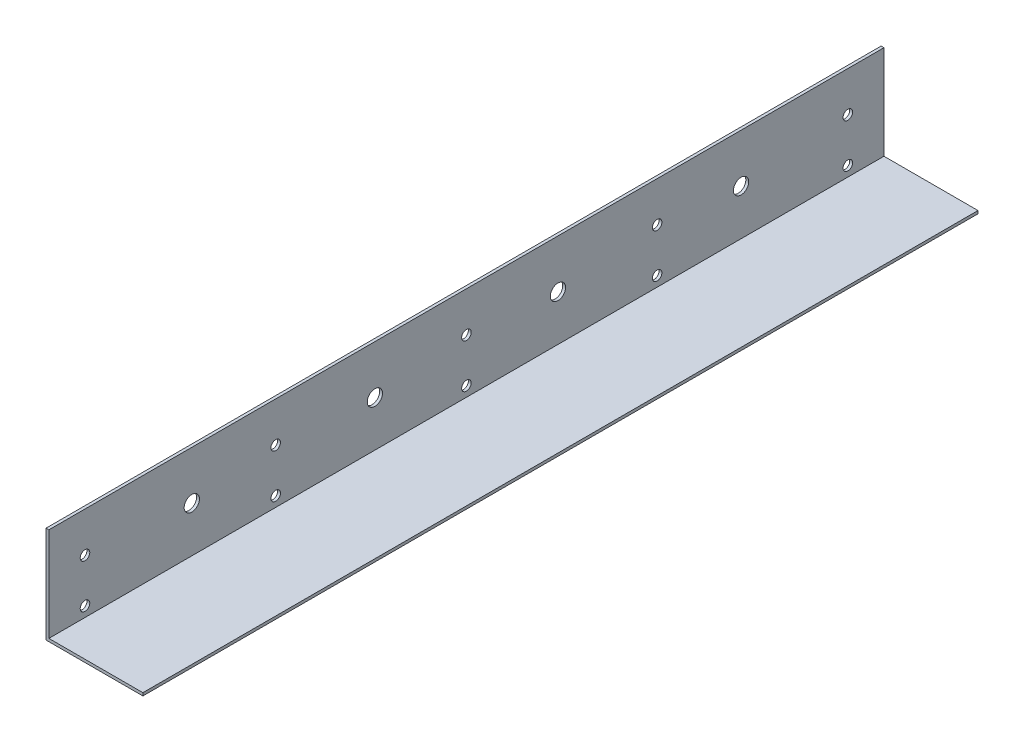
ISO-10303-21;
HEADER;
FILE_DESCRIPTION(('STEP AP214'),'2;1');
FILE_NAME('part.step','',(''),(''),'','','');
FILE_SCHEMA(('AUTOMOTIVE_DESIGN { 1 0 10303 214 1 1 1 1 }'));
ENDSEC;
DATA;
#1=APPLICATION_CONTEXT('core data for automotive mechanical design processes');
#2=APPLICATION_PROTOCOL_DEFINITION('international standard','automotive_design',2000,#1);
#3=PRODUCT_CONTEXT('',#1,'mechanical');
#4=PRODUCT('Part','Part','',(#3));
#5=PRODUCT_RELATED_PRODUCT_CATEGORY('part','',(#4));
#6=PRODUCT_DEFINITION_FORMATION('','',#4);
#7=PRODUCT_DEFINITION_CONTEXT('part definition',#1,'design');
#8=PRODUCT_DEFINITION('design','',#6,#7);
#9=PRODUCT_DEFINITION_SHAPE('','',#8);
#10=(LENGTH_UNIT() NAMED_UNIT(*) SI_UNIT(.MILLI.,.METRE.));
#11=(NAMED_UNIT(*) PLANE_ANGLE_UNIT() SI_UNIT($,.RADIAN.));
#12=(NAMED_UNIT(*) SI_UNIT($,.STERADIAN.) SOLID_ANGLE_UNIT());
#13=UNCERTAINTY_MEASURE_WITH_UNIT(LENGTH_MEASURE(1.E-05),#10,'distance_accuracy_value','');
#14=(GEOMETRIC_REPRESENTATION_CONTEXT(3) GLOBAL_UNCERTAINTY_ASSIGNED_CONTEXT((#13)) GLOBAL_UNIT_ASSIGNED_CONTEXT((#10,
#11,#12)) REPRESENTATION_CONTEXT('',''));
#15=CARTESIAN_POINT('',(0.,0.,0.));
#16=DIRECTION('',(0.,0.,1.));
#17=DIRECTION('',(1.,0.,0.));
#18=AXIS2_PLACEMENT_3D('',#15,#16,#17);
#19=CARTESIAN_POINT('',(0.,-2.22044604925031E-13,437.896));
#20=DIRECTION('',(0.,1.,0.));
#21=DIRECTION('',(0.,0.,1.));
#22=AXIS2_PLACEMENT_3D('',#19,#20,#21);
#23=PLANE('',#22);
#24=DIRECTION('',(1.,0.,0.));
#25=VECTOR('',#24,1.);
#26=CARTESIAN_POINT('',(0.,0.,0.));
#27=LINE('',#26,#25);
#28=CARTESIAN_POINT('',(0.,0.,0.));
#29=VERTEX_POINT('',#28);
#30=CARTESIAN_POINT('',(50.8,0.,0.));
#31=VERTEX_POINT('',#30);
#32=EDGE_CURVE('E120',#29,#31,#27,.T.);
#33=ORIENTED_EDGE('',*,*,#32,.T.);
#34=DIRECTION('',(0.,0.,-1.));
#35=VECTOR('',#34,1.);
#36=CARTESIAN_POINT('',(50.8,-1.66533453693773E-13,437.896));
#37=LINE('',#36,#35);
#38=CARTESIAN_POINT('',(50.8,-1.66533453693773E-13,437.896));
#39=VERTEX_POINT('',#38);
#40=EDGE_CURVE('E11',#39,#31,#37,.T.);
#41=ORIENTED_EDGE('',*,*,#40,.F.);
#42=DIRECTION('',(1.,0.,0.));
#43=VECTOR('',#42,1.);
#44=CARTESIAN_POINT('',(0.,-2.22044604925031E-13,437.896));
#45=LINE('',#44,#43);
#46=CARTESIAN_POINT('',(0.,-2.22044604925031E-13,437.896));
#47=VERTEX_POINT('',#46);
#48=EDGE_CURVE('E131',#47,#39,#45,.T.);
#49=ORIENTED_EDGE('',*,*,#48,.F.);
#50=DIRECTION('',(0.,0.,-1.));
#51=VECTOR('',#50,1.);
#52=CARTESIAN_POINT('',(0.,-2.22044604925031E-13,437.896));
#53=LINE('',#52,#51);
#54=EDGE_CURVE('E116',#47,#29,#53,.T.);
#55=ORIENTED_EDGE('',*,*,#54,.T.);
#56=EDGE_LOOP('',(#33,#41,#49,#55));
#57=FACE_BOUND('',#56,.T.);
#58=ADVANCED_FACE('F36',(#57),#23,.F.);
#59=CARTESIAN_POINT('',(50.8,1.49999699999981,437.896));
#60=DIRECTION('',(-1.,0.,0.));
#61=DIRECTION('',(0.,0.,1.));
#62=AXIS2_PLACEMENT_3D('',#59,#60,#61);
#63=PLANE('',#62);
#64=DIRECTION('',(0.,1.,0.));
#65=VECTOR('',#64,1.);
#66=CARTESIAN_POINT('',(50.8,1.49999700000003,0.));
#67=LINE('',#66,#65);
#68=CARTESIAN_POINT('',(50.8,1.49999700000003,0.));
#69=VERTEX_POINT('',#68);
#70=EDGE_CURVE('E123',#31,#69,#67,.T.);
#71=ORIENTED_EDGE('',*,*,#70,.T.);
#72=DIRECTION('',(0.,0.,-1.));
#73=VECTOR('',#72,1.);
#74=CARTESIAN_POINT('',(50.8,1.49999699999981,437.896));
#75=LINE('',#74,#73);
#76=CARTESIAN_POINT('',(50.8,1.49999699999981,437.896));
#77=VERTEX_POINT('',#76);
#78=EDGE_CURVE('E44',#77,#69,#75,.T.);
#79=ORIENTED_EDGE('',*,*,#78,.F.);
#80=DIRECTION('',(0.,1.,0.));
#81=VECTOR('',#80,1.);
#82=CARTESIAN_POINT('',(50.8,1.49999699999981,437.896));
#83=LINE('',#82,#81);
#84=EDGE_CURVE('E89',#39,#77,#83,.T.);
#85=ORIENTED_EDGE('',*,*,#84,.F.);
#86=ORIENTED_EDGE('',*,*,#40,.T.);
#87=EDGE_LOOP('',(#71,#79,#85,#86));
#88=FACE_BOUND('',#87,.T.);
#89=ADVANCED_FACE('F158',(#88),#63,.F.);
#90=CARTESIAN_POINT('',(1.499997,1.49999699999981,437.896));
#91=DIRECTION('',(0.,-1.,0.));
#92=DIRECTION('',(0.,0.,-1.));
#93=AXIS2_PLACEMENT_3D('',#90,#91,#92);
#94=PLANE('',#93);
#95=DIRECTION('',(-1.,0.,0.));
#96=VECTOR('',#95,1.);
#97=CARTESIAN_POINT('',(1.499997,1.49999699999998,0.));
#98=LINE('',#97,#96);
#99=CARTESIAN_POINT('',(1.499997,1.49999699999998,0.));
#100=VERTEX_POINT('',#99);
#101=EDGE_CURVE('E126',#69,#100,#98,.T.);
#102=ORIENTED_EDGE('',*,*,#101,.T.);
#103=DIRECTION('',(0.,0.,-1.));
#104=VECTOR('',#103,1.);
#105=CARTESIAN_POINT('',(1.499997,1.49999699999981,437.896));
#106=LINE('',#105,#104);
#107=CARTESIAN_POINT('',(1.499997,1.49999699999981,437.896));
#108=VERTEX_POINT('',#107);
#109=EDGE_CURVE('E111',#108,#100,#106,.T.);
#110=ORIENTED_EDGE('',*,*,#109,.F.);
#111=DIRECTION('',(-1.,0.,0.));
#112=VECTOR('',#111,1.);
#113=CARTESIAN_POINT('',(1.499997,1.49999699999981,437.896));
#114=LINE('',#113,#112);
#115=EDGE_CURVE('E102',#77,#108,#114,.T.);
#116=ORIENTED_EDGE('',*,*,#115,.F.);
#117=ORIENTED_EDGE('',*,*,#78,.T.);
#118=EDGE_LOOP('',(#102,#110,#116,#117));
#119=FACE_BOUND('',#118,.T.);
#120=ADVANCED_FACE('F137',(#119),#94,.F.);
#121=CARTESIAN_POINT('',(1.499997,1.49999699999981,437.896));
#122=DIRECTION('',(-1.,0.,0.));
#123=DIRECTION('',(0.,0.,1.));
#124=AXIS2_PLACEMENT_3D('',#121,#122,#123);
#125=PLANE('',#124);
#126=CARTESIAN_POINT('',(1.499997,29.8000000000049,118.948));
#127=DIRECTION('',(-1.,0.,0.));
#128=DIRECTION('',(0.,0.,1.));
#129=AXIS2_PLACEMENT_3D('',#126,#127,#128);
#130=CIRCLE('',#129,2.49999999999999);
#131=CARTESIAN_POINT('',(1.499997,29.8000000000049,121.448));
#132=VERTEX_POINT('',#131);
#133=EDGE_CURVE('E174',#132,#132,#130,.F.);
#134=ORIENTED_EDGE('',*,*,#133,.F.);
#135=EDGE_LOOP('',(#134));
#136=FACE_BOUND('',#135,.T.);
#137=CARTESIAN_POINT('',(1.499997,29.8000000000057,218.948));
#138=DIRECTION('',(-1.,0.,0.));
#139=DIRECTION('',(0.,0.,1.));
#140=AXIS2_PLACEMENT_3D('',#137,#138,#139);
#141=CIRCLE('',#140,2.5);
#142=CARTESIAN_POINT('',(1.499997,29.8000000000057,221.448));
#143=VERTEX_POINT('',#142);
#144=EDGE_CURVE('E178',#143,#143,#141,.F.);
#145=ORIENTED_EDGE('',*,*,#144,.F.);
#146=EDGE_LOOP('',(#145));
#147=FACE_BOUND('',#146,.T.);
#148=CARTESIAN_POINT('',(1.49999700000011,29.8000000000067,318.948));
#149=DIRECTION('',(-1.,0.,0.));
#150=DIRECTION('',(0.,0.,1.));
#151=AXIS2_PLACEMENT_3D('',#148,#149,#150);
#152=CIRCLE('',#151,2.50000000000002);
#153=CARTESIAN_POINT('',(1.49999700000011,29.8000000000067,321.448));
#154=VERTEX_POINT('',#153);
#155=EDGE_CURVE('E182',#154,#154,#152,.F.);
#156=ORIENTED_EDGE('',*,*,#155,.F.);
#157=EDGE_LOOP('',(#156));
#158=FACE_BOUND('',#157,.T.);
#159=CARTESIAN_POINT('',(1.4999970000001,29.8000000000077,418.948));
#160=DIRECTION('',(-1.,0.,0.));
#161=DIRECTION('',(0.,0.,1.));
#162=AXIS2_PLACEMENT_3D('',#159,#160,#161);
#163=CIRCLE('',#162,2.50000000000002);
#164=CARTESIAN_POINT('',(1.4999970000001,29.8000000000077,421.448));
#165=VERTEX_POINT('',#164);
#166=EDGE_CURVE('E186',#165,#165,#163,.F.);
#167=ORIENTED_EDGE('',*,*,#166,.F.);
#168=EDGE_LOOP('',(#167));
#169=FACE_BOUND('',#168,.T.);
#170=CARTESIAN_POINT('',(1.499997,6.8000000000088,318.948));
#171=DIRECTION('',(-1.,0.,0.));
#172=DIRECTION('',(0.,0.,1.));
#173=AXIS2_PLACEMENT_3D('',#170,#171,#172);
#174=CIRCLE('',#173,2.50000000000002);
#175=CARTESIAN_POINT('',(1.499997,6.8000000000088,321.448));
#176=VERTEX_POINT('',#175);
#177=EDGE_CURVE('E190',#176,#176,#174,.F.);
#178=ORIENTED_EDGE('',*,*,#177,.F.);
#179=EDGE_LOOP('',(#178));
#180=FACE_BOUND('',#179,.T.);
#181=CARTESIAN_POINT('',(1.499997,6.80000000001119,118.948));
#182=DIRECTION('',(-1.,0.,0.));
#183=DIRECTION('',(0.,0.,1.));
#184=AXIS2_PLACEMENT_3D('',#181,#182,#183);
#185=CIRCLE('',#184,2.5);
#186=CARTESIAN_POINT('',(1.499997,6.80000000001119,121.448));
#187=VERTEX_POINT('',#186);
#188=EDGE_CURVE('E194',#187,#187,#185,.F.);
#189=ORIENTED_EDGE('',*,*,#188,.F.);
#190=EDGE_LOOP('',(#189));
#191=FACE_BOUND('',#190,.T.);
#192=CARTESIAN_POINT('',(1.49999699999999,6.80000000000985,218.948));
#193=DIRECTION('',(-1.,0.,0.));
#194=DIRECTION('',(0.,0.,1.));
#195=AXIS2_PLACEMENT_3D('',#192,#193,#194);
#196=CIRCLE('',#195,2.5);
#197=CARTESIAN_POINT('',(1.49999699999999,6.80000000000985,221.448));
#198=VERTEX_POINT('',#197);
#199=EDGE_CURVE('E198',#198,#198,#196,.F.);
#200=ORIENTED_EDGE('',*,*,#199,.F.);
#201=EDGE_LOOP('',(#200));
#202=FACE_BOUND('',#201,.T.);
#203=CARTESIAN_POINT('',(1.499997,6.80000000001207,18.9479999999998));
#204=DIRECTION('',(-1.,0.,0.));
#205=DIRECTION('',(0.,0.,1.));
#206=AXIS2_PLACEMENT_3D('',#203,#204,#205);
#207=CIRCLE('',#206,2.5);
#208=CARTESIAN_POINT('',(1.499997,6.80000000001207,21.4479999999998));
#209=VERTEX_POINT('',#208);
#210=EDGE_CURVE('E202',#209,#209,#207,.F.);
#211=ORIENTED_EDGE('',*,*,#210,.F.);
#212=EDGE_LOOP('',(#211));
#213=FACE_BOUND('',#212,.T.);
#214=CARTESIAN_POINT('',(1.499997,6.80000000000769,418.948));
#215=DIRECTION('',(-1.,0.,0.));
#216=DIRECTION('',(0.,0.,1.));
#217=AXIS2_PLACEMENT_3D('',#214,#215,#216);
#218=CIRCLE('',#217,2.50000000000002);
#219=CARTESIAN_POINT('',(1.499997,6.80000000000769,421.448));
#220=VERTEX_POINT('',#219);
#221=EDGE_CURVE('E206',#220,#220,#218,.F.);
#222=ORIENTED_EDGE('',*,*,#221,.F.);
#223=EDGE_LOOP('',(#222));
#224=FACE_BOUND('',#223,.T.);
#225=CARTESIAN_POINT('',(1.49999700000006,29.8000000000037,18.948));
#226=DIRECTION('',(-1.,0.,0.));
#227=DIRECTION('',(0.,0.,1.));
#228=AXIS2_PLACEMENT_3D('',#225,#226,#227);
#229=CIRCLE('',#228,2.5);
#230=CARTESIAN_POINT('',(1.49999700000006,29.8000000000037,21.448));
#231=VERTEX_POINT('',#230);
#232=EDGE_CURVE('E210',#231,#231,#229,.F.);
#233=ORIENTED_EDGE('',*,*,#232,.F.);
#234=EDGE_LOOP('',(#233));
#235=FACE_BOUND('',#234,.T.);
#236=CARTESIAN_POINT('',(1.49999700000011,25.3999999999998,170.948));
#237=DIRECTION('',(-1.,0.,0.));
#238=DIRECTION('',(0.,0.,1.));
#239=AXIS2_PLACEMENT_3D('',#236,#237,#238);
#240=CIRCLE('',#239,3.99999200000001);
#241=CARTESIAN_POINT('',(1.49999700000011,25.3999999999998,174.947992));
#242=VERTEX_POINT('',#241);
#243=EDGE_CURVE('E214',#242,#242,#240,.T.);
#244=ORIENTED_EDGE('',*,*,#243,.T.);
#245=EDGE_LOOP('',(#244));
#246=FACE_BOUND('',#245,.T.);
#247=CARTESIAN_POINT('',(1.49999700000006,25.3999999999998,74.9479999999997));
#248=DIRECTION('',(-1.,0.,0.));
#249=DIRECTION('',(0.,0.,1.));
#250=AXIS2_PLACEMENT_3D('',#247,#248,#249);
#251=CIRCLE('',#250,3.99999199999999);
#252=CARTESIAN_POINT('',(1.49999700000006,25.3999999999998,78.9479919999997));
#253=VERTEX_POINT('',#252);
#254=EDGE_CURVE('E218',#253,#253,#251,.T.);
#255=ORIENTED_EDGE('',*,*,#254,.T.);
#256=EDGE_LOOP('',(#255));
#257=FACE_BOUND('',#256,.T.);
#258=CARTESIAN_POINT('',(1.4999970000001,25.3999999999998,362.948));
#259=DIRECTION('',(-1.,0.,0.));
#260=DIRECTION('',(0.,0.,1.));
#261=AXIS2_PLACEMENT_3D('',#258,#259,#260);
#262=CIRCLE('',#261,3.99999200000003);
#263=CARTESIAN_POINT('',(1.4999970000001,25.3999999999998,366.947992));
#264=VERTEX_POINT('',#263);
#265=EDGE_CURVE('E222',#264,#264,#262,.T.);
#266=ORIENTED_EDGE('',*,*,#265,.T.);
#267=EDGE_LOOP('',(#266));
#268=FACE_BOUND('',#267,.T.);
#269=CARTESIAN_POINT('',(1.49999700000006,25.3999999999998,266.948));
#270=DIRECTION('',(-1.,0.,0.));
#271=DIRECTION('',(0.,0.,1.));
#272=AXIS2_PLACEMENT_3D('',#269,#270,#271);
#273=CIRCLE('',#272,3.99999200000003);
#274=CARTESIAN_POINT('',(1.49999700000006,25.3999999999998,270.947992));
#275=VERTEX_POINT('',#274);
#276=EDGE_CURVE('E124',#275,#275,#273,.T.);
#277=ORIENTED_EDGE('',*,*,#276,.T.);
#278=EDGE_LOOP('',(#277));
#279=FACE_BOUND('',#278,.T.);
#280=DIRECTION('',(0.,1.,0.));
#281=VECTOR('',#280,1.);
#282=CARTESIAN_POINT('',(1.499997,1.49999699999998,0.));
#283=LINE('',#282,#281);
#284=CARTESIAN_POINT('',(1.49999700000006,50.8,-1.66533453693773E-13));
#285=VERTEX_POINT('',#284);
#286=EDGE_CURVE('E110',#100,#285,#283,.T.);
#287=ORIENTED_EDGE('',*,*,#286,.T.);
#288=DIRECTION('',(0.,0.,-1.));
#289=VECTOR('',#288,1.);
#290=CARTESIAN_POINT('',(1.49999700000006,50.7999999999998,437.896));
#291=LINE('',#290,#289);
#292=CARTESIAN_POINT('',(1.49999700000006,50.7999999999998,437.896));
#293=VERTEX_POINT('',#292);
#294=EDGE_CURVE('E107',#293,#285,#291,.T.);
#295=ORIENTED_EDGE('',*,*,#294,.F.);
#296=DIRECTION('',(0.,1.,0.));
#297=VECTOR('',#296,1.);
#298=CARTESIAN_POINT('',(1.499997,1.49999699999981,437.896));
#299=LINE('',#298,#297);
#300=EDGE_CURVE('E96',#108,#293,#299,.T.);
#301=ORIENTED_EDGE('',*,*,#300,.F.);
#302=ORIENTED_EDGE('',*,*,#109,.T.);
#303=EDGE_LOOP('',(#287,#295,#301,#302));
#304=FACE_BOUND('',#303,.T.);
#305=ADVANCED_FACE('F108',(#136,#147,#158,#169,#180,#191,#202,#213,#224,#235,#246,#257,#268,
#279,#304),#125,.F.);
#306=CARTESIAN_POINT('',(0.,50.7999999999998,437.896));
#307=DIRECTION('',(0.,-1.,0.));
#308=DIRECTION('',(0.,0.,-1.));
#309=AXIS2_PLACEMENT_3D('',#306,#307,#308);
#310=PLANE('',#309);
#311=DIRECTION('',(-1.,0.,0.));
#312=VECTOR('',#311,1.);
#313=CARTESIAN_POINT('',(0.,50.8,-1.66533453693773E-13));
#314=LINE('',#313,#312);
#315=CARTESIAN_POINT('',(0.,50.8,-1.66533453693773E-13));
#316=VERTEX_POINT('',#315);
#317=EDGE_CURVE('E75',#285,#316,#314,.T.);
#318=ORIENTED_EDGE('',*,*,#317,.T.);
#319=DIRECTION('',(0.,0.,-1.));
#320=VECTOR('',#319,1.);
#321=CARTESIAN_POINT('',(0.,50.7999999999998,437.896));
#322=LINE('',#321,#320);
#323=CARTESIAN_POINT('',(0.,50.7999999999998,437.896));
#324=VERTEX_POINT('',#323);
#325=EDGE_CURVE('E112',#324,#316,#322,.T.);
#326=ORIENTED_EDGE('',*,*,#325,.F.);
#327=DIRECTION('',(-1.,0.,0.));
#328=VECTOR('',#327,1.);
#329=CARTESIAN_POINT('',(0.,50.7999999999998,437.896));
#330=LINE('',#329,#328);
#331=EDGE_CURVE('E100',#293,#324,#330,.T.);
#332=ORIENTED_EDGE('',*,*,#331,.F.);
#333=ORIENTED_EDGE('',*,*,#294,.T.);
#334=EDGE_LOOP('',(#318,#326,#332,#333));
#335=FACE_BOUND('',#334,.T.);
#336=ADVANCED_FACE('F114',(#335),#310,.F.);
#337=CARTESIAN_POINT('',(0.,-2.22044604925031E-13,437.896));
#338=DIRECTION('',(1.,0.,0.));
#339=DIRECTION('',(0.,0.,-1.));
#340=AXIS2_PLACEMENT_3D('',#337,#338,#339);
#341=PLANE('',#340);
#342=CARTESIAN_POINT('',(0.,29.8000000000049,118.948));
#343=DIRECTION('',(-1.,0.,0.));
#344=DIRECTION('',(0.,0.,1.));
#345=AXIS2_PLACEMENT_3D('',#342,#343,#344);
#346=CIRCLE('',#345,2.49999999999999);
#347=CARTESIAN_POINT('',(0.,29.8000000000049,121.448));
#348=VERTEX_POINT('',#347);
#349=EDGE_CURVE('E275',#348,#348,#346,.T.);
#350=ORIENTED_EDGE('',*,*,#349,.F.);
#351=EDGE_LOOP('',(#350));
#352=FACE_BOUND('',#351,.T.);
#353=CARTESIAN_POINT('',(0.,29.8000000000057,218.948));
#354=DIRECTION('',(-1.,0.,0.));
#355=DIRECTION('',(0.,0.,1.));
#356=AXIS2_PLACEMENT_3D('',#353,#354,#355);
#357=CIRCLE('',#356,2.5);
#358=CARTESIAN_POINT('',(0.,29.8000000000057,221.448));
#359=VERTEX_POINT('',#358);
#360=EDGE_CURVE('E271',#359,#359,#357,.T.);
#361=ORIENTED_EDGE('',*,*,#360,.F.);
#362=EDGE_LOOP('',(#361));
#363=FACE_BOUND('',#362,.T.);
#364=CARTESIAN_POINT('',(1.11022302462516E-13,29.8000000000067,318.948));
#365=DIRECTION('',(-1.,0.,0.));
#366=DIRECTION('',(0.,0.,1.));
#367=AXIS2_PLACEMENT_3D('',#364,#365,#366);
#368=CIRCLE('',#367,2.50000000000002);
#369=CARTESIAN_POINT('',(1.11022302462685E-13,29.8000000000067,321.448));
#370=VERTEX_POINT('',#369);
#371=EDGE_CURVE('E267',#370,#370,#368,.T.);
#372=ORIENTED_EDGE('',*,*,#371,.F.);
#373=EDGE_LOOP('',(#372));
#374=FACE_BOUND('',#373,.T.);
#375=CARTESIAN_POINT('',(1.11022302462516E-13,29.8000000000077,418.948));
#376=DIRECTION('',(-1.,0.,0.));
#377=DIRECTION('',(0.,0.,1.));
#378=AXIS2_PLACEMENT_3D('',#375,#376,#377);
#379=CIRCLE('',#378,2.50000000000002);
#380=CARTESIAN_POINT('',(1.11022302462685E-13,29.8000000000077,421.448));
#381=VERTEX_POINT('',#380);
#382=EDGE_CURVE('E255',#381,#381,#379,.T.);
#383=ORIENTED_EDGE('',*,*,#382,.F.);
#384=EDGE_LOOP('',(#383));
#385=FACE_BOUND('',#384,.T.);
#386=CARTESIAN_POINT('',(0.,6.8000000000088,318.948));
#387=DIRECTION('',(-1.,0.,0.));
#388=DIRECTION('',(0.,0.,1.));
#389=AXIS2_PLACEMENT_3D('',#386,#387,#388);
#390=CIRCLE('',#389,2.50000000000002);
#391=CARTESIAN_POINT('',(0.,6.8000000000088,321.448));
#392=VERTEX_POINT('',#391);
#393=EDGE_CURVE('E260',#392,#392,#390,.T.);
#394=ORIENTED_EDGE('',*,*,#393,.F.);
#395=EDGE_LOOP('',(#394));
#396=FACE_BOUND('',#395,.T.);
#397=CARTESIAN_POINT('',(0.,6.80000000001119,118.948));
#398=DIRECTION('',(-1.,0.,0.));
#399=DIRECTION('',(0.,0.,1.));
#400=AXIS2_PLACEMENT_3D('',#397,#398,#399);
#401=CIRCLE('',#400,2.5);
#402=CARTESIAN_POINT('',(0.,6.80000000001119,121.448));
#403=VERTEX_POINT('',#402);
#404=EDGE_CURVE('E259',#403,#403,#401,.T.);
#405=ORIENTED_EDGE('',*,*,#404,.F.);
#406=EDGE_LOOP('',(#405));
#407=FACE_BOUND('',#406,.T.);
#408=CARTESIAN_POINT('',(0.,6.80000000000985,218.948));
#409=DIRECTION('',(-1.,0.,0.));
#410=DIRECTION('',(0.,0.,1.));
#411=AXIS2_PLACEMENT_3D('',#408,#409,#410);
#412=CIRCLE('',#411,2.5);
#413=CARTESIAN_POINT('',(0.,6.80000000000985,221.448));
#414=VERTEX_POINT('',#413);
#415=EDGE_CURVE('E251',#414,#414,#412,.T.);
#416=ORIENTED_EDGE('',*,*,#415,.F.);
#417=EDGE_LOOP('',(#416));
#418=FACE_BOUND('',#417,.T.);
#419=CARTESIAN_POINT('',(0.,6.80000000001207,18.9479999999997));
#420=DIRECTION('',(-1.,0.,0.));
#421=DIRECTION('',(0.,0.,1.));
#422=AXIS2_PLACEMENT_3D('',#419,#420,#421);
#423=CIRCLE('',#422,2.5);
#424=CARTESIAN_POINT('',(0.,6.80000000001207,21.4479999999997));
#425=VERTEX_POINT('',#424);
#426=EDGE_CURVE('E250',#425,#425,#423,.T.);
#427=ORIENTED_EDGE('',*,*,#426,.F.);
#428=EDGE_LOOP('',(#427));
#429=FACE_BOUND('',#428,.T.);
#430=CARTESIAN_POINT('',(0.,6.80000000000769,418.948));
#431=DIRECTION('',(-1.,0.,0.));
#432=DIRECTION('',(0.,0.,1.));
#433=AXIS2_PLACEMENT_3D('',#430,#431,#432);
#434=CIRCLE('',#433,2.50000000000002);
#435=CARTESIAN_POINT('',(0.,6.80000000000769,421.448));
#436=VERTEX_POINT('',#435);
#437=EDGE_CURVE('E282',#436,#436,#434,.T.);
#438=ORIENTED_EDGE('',*,*,#437,.F.);
#439=EDGE_LOOP('',(#438));
#440=FACE_BOUND('',#439,.T.);
#441=CARTESIAN_POINT('',(0.,29.8000000000038,18.948));
#442=DIRECTION('',(-1.,0.,0.));
#443=DIRECTION('',(0.,0.,1.));
#444=AXIS2_PLACEMENT_3D('',#441,#442,#443);
#445=CIRCLE('',#444,2.5);
#446=CARTESIAN_POINT('',(0.,29.8000000000038,21.448));
#447=VERTEX_POINT('',#446);
#448=EDGE_CURVE('E246',#447,#447,#445,.T.);
#449=ORIENTED_EDGE('',*,*,#448,.F.);
#450=EDGE_LOOP('',(#449));
#451=FACE_BOUND('',#450,.T.);
#452=CARTESIAN_POINT('',(1.11022302462516E-13,25.3999999999998,170.948));
#453=DIRECTION('',(-1.,0.,0.));
#454=DIRECTION('',(0.,0.,-1.));
#455=AXIS2_PLACEMENT_3D('',#452,#453,#454);
#456=CIRCLE('',#455,3.99999200000001);
#457=CARTESIAN_POINT('',(1.11022302462244E-13,25.3999999999998,166.948008));
#458=VERTEX_POINT('',#457);
#459=EDGE_CURVE('E242',#458,#458,#456,.T.);
#460=ORIENTED_EDGE('',*,*,#459,.F.);
#461=EDGE_LOOP('',(#460));
#462=FACE_BOUND('',#461,.T.);
#463=CARTESIAN_POINT('',(0.,25.4,74.9479999999997));
#464=DIRECTION('',(-1.,0.,0.));
#465=DIRECTION('',(0.,0.,-1.));
#466=AXIS2_PLACEMENT_3D('',#463,#464,#465);
#467=CIRCLE('',#466,3.99999199999999);
#468=CARTESIAN_POINT('',(0.,25.4,70.9480079999997));
#469=VERTEX_POINT('',#468);
#470=EDGE_CURVE('E238',#469,#469,#467,.T.);
#471=ORIENTED_EDGE('',*,*,#470,.F.);
#472=EDGE_LOOP('',(#471));
#473=FACE_BOUND('',#472,.T.);
#474=CARTESIAN_POINT('',(1.11022302462516E-13,25.3999999999998,362.948));
#475=DIRECTION('',(-1.,0.,0.));
#476=DIRECTION('',(0.,0.,1.));
#477=AXIS2_PLACEMENT_3D('',#474,#475,#476);
#478=CIRCLE('',#477,3.99999200000003);
#479=CARTESIAN_POINT('',(1.11022302462787E-13,25.3999999999998,366.947992));
#480=VERTEX_POINT('',#479);
#481=EDGE_CURVE('E234',#480,#480,#478,.T.);
#482=ORIENTED_EDGE('',*,*,#481,.F.);
#483=EDGE_LOOP('',(#482));
#484=FACE_BOUND('',#483,.T.);
#485=CARTESIAN_POINT('',(0.,25.3999999999998,266.948));
#486=DIRECTION('',(-1.,0.,0.));
#487=DIRECTION('',(0.,0.,1.));
#488=AXIS2_PLACEMENT_3D('',#485,#486,#487);
#489=CIRCLE('',#488,3.99999200000003);
#490=CARTESIAN_POINT('',(0.,25.3999999999998,270.947992));
#491=VERTEX_POINT('',#490);
#492=EDGE_CURVE('E226',#491,#491,#489,.T.);
#493=ORIENTED_EDGE('',*,*,#492,.F.);
#494=EDGE_LOOP('',(#493));
#495=FACE_BOUND('',#494,.T.);
#496=DIRECTION('',(0.,-1.,0.));
#497=VECTOR('',#496,1.);
#498=CARTESIAN_POINT('',(0.,0.,0.));
#499=LINE('',#498,#497);
#500=EDGE_CURVE('E81',#316,#29,#499,.T.);
#501=ORIENTED_EDGE('',*,*,#500,.T.);
#502=ORIENTED_EDGE('',*,*,#54,.F.);
#503=DIRECTION('',(0.,-1.,0.));
#504=VECTOR('',#503,1.);
#505=CARTESIAN_POINT('',(0.,-2.22044604925031E-13,437.896));
#506=LINE('',#505,#504);
#507=EDGE_CURVE('E52',#324,#47,#506,.T.);
#508=ORIENTED_EDGE('',*,*,#507,.F.);
#509=ORIENTED_EDGE('',*,*,#325,.T.);
#510=EDGE_LOOP('',(#501,#502,#508,#509));
#511=FACE_BOUND('',#510,.T.);
#512=ADVANCED_FACE('F144',(#352,#363,#374,#385,#396,#407,#418,#429,#440,#451,#462,#473,#484,
#495,#511),#341,.F.);
#513=CARTESIAN_POINT('',(0.,-2.22044604925031E-13,437.896));
#514=DIRECTION('',(0.,0.,-1.));
#515=DIRECTION('',(-1.,0.,0.));
#516=AXIS2_PLACEMENT_3D('',#513,#514,#515);
#517=PLANE('',#516);
#518=ORIENTED_EDGE('',*,*,#48,.T.);
#519=ORIENTED_EDGE('',*,*,#84,.T.);
#520=ORIENTED_EDGE('',*,*,#115,.T.);
#521=ORIENTED_EDGE('',*,*,#300,.T.);
#522=ORIENTED_EDGE('',*,*,#331,.T.);
#523=ORIENTED_EDGE('',*,*,#507,.T.);
#524=EDGE_LOOP('',(#518,#519,#520,#521,#522,#523));
#525=FACE_BOUND('',#524,.T.);
#526=ADVANCED_FACE('F98',(#525),#517,.F.);
#527=CARTESIAN_POINT('',(0.,0.,0.));
#528=DIRECTION('',(0.,0.,-1.));
#529=DIRECTION('',(-1.,0.,0.));
#530=AXIS2_PLACEMENT_3D('',#527,#528,#529);
#531=PLANE('',#530);
#532=ORIENTED_EDGE('',*,*,#32,.F.);
#533=ORIENTED_EDGE('',*,*,#500,.F.);
#534=ORIENTED_EDGE('',*,*,#317,.F.);
#535=ORIENTED_EDGE('',*,*,#286,.F.);
#536=ORIENTED_EDGE('',*,*,#101,.F.);
#537=ORIENTED_EDGE('',*,*,#70,.F.);
#538=EDGE_LOOP('',(#532,#533,#534,#535,#536,#537));
#539=FACE_BOUND('',#538,.T.);
#540=ADVANCED_FACE('F140',(#539),#531,.T.);
#541=CARTESIAN_POINT('',(4.06400000000003,25.3999999999999,266.948));
#542=DIRECTION('',(-1.,0.,0.));
#543=DIRECTION('',(0.,0.,1.));
#544=AXIS2_PLACEMENT_3D('',#541,#542,#543);
#545=CYLINDRICAL_SURFACE('',#544,3.99999200000003);
#546=ORIENTED_EDGE('',*,*,#492,.T.);
#547=EDGE_LOOP('',(#546));
#548=FACE_BOUND('',#547,.T.);
#549=ORIENTED_EDGE('',*,*,#276,.F.);
#550=EDGE_LOOP('',(#549));
#551=FACE_BOUND('',#550,.T.);
#552=ADVANCED_FACE('F299',(#548,#551),#545,.F.);
#553=CARTESIAN_POINT('',(4.06400000000005,25.4,362.948));
#554=DIRECTION('',(-1.,0.,0.));
#555=DIRECTION('',(0.,0.,1.));
#556=AXIS2_PLACEMENT_3D('',#553,#554,#555);
#557=CYLINDRICAL_SURFACE('',#556,3.99999200000003);
#558=ORIENTED_EDGE('',*,*,#481,.T.);
#559=EDGE_LOOP('',(#558));
#560=FACE_BOUND('',#559,.T.);
#561=ORIENTED_EDGE('',*,*,#265,.F.);
#562=EDGE_LOOP('',(#561));
#563=FACE_BOUND('',#562,.T.);
#564=ADVANCED_FACE('F301',(#560,#563),#557,.F.);
#565=CARTESIAN_POINT('',(4.06400000000005,25.4,74.9479999999997));
#566=DIRECTION('',(-1.,0.,0.));
#567=DIRECTION('',(0.,0.,1.));
#568=AXIS2_PLACEMENT_3D('',#565,#566,#567);
#569=CYLINDRICAL_SURFACE('',#568,3.99999199999999);
#570=ORIENTED_EDGE('',*,*,#470,.T.);
#571=EDGE_LOOP('',(#570));
#572=FACE_BOUND('',#571,.T.);
#573=ORIENTED_EDGE('',*,*,#254,.F.);
#574=EDGE_LOOP('',(#573));
#575=FACE_BOUND('',#574,.T.);
#576=ADVANCED_FACE('F307',(#572,#575),#569,.F.);
#577=CARTESIAN_POINT('',(4.06400000000005,25.4,170.948));
#578=DIRECTION('',(-1.,0.,0.));
#579=DIRECTION('',(0.,0.,1.));
#580=AXIS2_PLACEMENT_3D('',#577,#578,#579);
#581=CYLINDRICAL_SURFACE('',#580,3.99999200000001);
#582=ORIENTED_EDGE('',*,*,#459,.T.);
#583=EDGE_LOOP('',(#582));
#584=FACE_BOUND('',#583,.T.);
#585=ORIENTED_EDGE('',*,*,#243,.F.);
#586=EDGE_LOOP('',(#585));
#587=FACE_BOUND('',#586,.T.);
#588=ADVANCED_FACE('F313',(#584,#587),#581,.F.);
#589=CARTESIAN_POINT('',(8.57106481186554,29.8000000000039,18.9480000000001));
#590=DIRECTION('',(-1.,0.,0.));
#591=DIRECTION('',(0.,0.,1.));
#592=AXIS2_PLACEMENT_3D('',#589,#590,#591);
#593=CYLINDRICAL_SURFACE('',#592,2.5);
#594=ORIENTED_EDGE('',*,*,#232,.T.);
#595=EDGE_LOOP('',(#594));
#596=FACE_BOUND('',#595,.T.);
#597=ORIENTED_EDGE('',*,*,#448,.T.);
#598=EDGE_LOOP('',(#597));
#599=FACE_BOUND('',#598,.T.);
#600=ADVANCED_FACE('F317',(#596,#599),#593,.F.);
#601=CARTESIAN_POINT('',(8.57106481186554,6.80000000000786,418.948));
#602=DIRECTION('',(-1.,0.,0.));
#603=DIRECTION('',(0.,0.,1.));
#604=AXIS2_PLACEMENT_3D('',#601,#602,#603);
#605=CYLINDRICAL_SURFACE('',#604,2.50000000000002);
#606=ORIENTED_EDGE('',*,*,#221,.T.);
#607=EDGE_LOOP('',(#606));
#608=FACE_BOUND('',#607,.T.);
#609=ORIENTED_EDGE('',*,*,#437,.T.);
#610=EDGE_LOOP('',(#609));
#611=FACE_BOUND('',#610,.T.);
#612=ADVANCED_FACE('F286',(#608,#611),#605,.F.);
#613=CARTESIAN_POINT('',(8.57106481186553,6.80000000001224,18.9479999999999));
#614=DIRECTION('',(-1.,0.,0.));
#615=DIRECTION('',(0.,0.,1.));
#616=AXIS2_PLACEMENT_3D('',#613,#614,#615);
#617=CYLINDRICAL_SURFACE('',#616,2.5);
#618=ORIENTED_EDGE('',*,*,#210,.T.);
#619=EDGE_LOOP('',(#618));
#620=FACE_BOUND('',#619,.T.);
#621=ORIENTED_EDGE('',*,*,#426,.T.);
#622=EDGE_LOOP('',(#621));
#623=FACE_BOUND('',#622,.T.);
#624=ADVANCED_FACE('F326',(#620,#623),#617,.F.);
#625=CARTESIAN_POINT('',(8.57106481186553,6.80000000001008,218.948));
#626=DIRECTION('',(-1.,0.,0.));
#627=DIRECTION('',(0.,0.,1.));
#628=AXIS2_PLACEMENT_3D('',#625,#626,#627);
#629=CYLINDRICAL_SURFACE('',#628,2.5);
#630=ORIENTED_EDGE('',*,*,#199,.T.);
#631=EDGE_LOOP('',(#630));
#632=FACE_BOUND('',#631,.T.);
#633=ORIENTED_EDGE('',*,*,#415,.T.);
#634=EDGE_LOOP('',(#633));
#635=FACE_BOUND('',#634,.T.);
#636=ADVANCED_FACE('F322',(#632,#635),#629,.F.);
#637=CARTESIAN_POINT('',(8.57106481186552,6.80000000001141,118.948));
#638=DIRECTION('',(-1.,0.,0.));
#639=DIRECTION('',(0.,0.,1.));
#640=AXIS2_PLACEMENT_3D('',#637,#638,#639);
#641=CYLINDRICAL_SURFACE('',#640,2.5);
#642=ORIENTED_EDGE('',*,*,#188,.T.);
#643=EDGE_LOOP('',(#642));
#644=FACE_BOUND('',#643,.T.);
#645=ORIENTED_EDGE('',*,*,#404,.T.);
#646=EDGE_LOOP('',(#645));
#647=FACE_BOUND('',#646,.T.);
#648=ADVANCED_FACE('F325',(#644,#647),#641,.F.);
#649=CARTESIAN_POINT('',(8.57106481186552,6.80000000000897,318.948));
#650=DIRECTION('',(-1.,0.,0.));
#651=DIRECTION('',(0.,0.,1.));
#652=AXIS2_PLACEMENT_3D('',#649,#650,#651);
#653=CYLINDRICAL_SURFACE('',#652,2.50000000000002);
#654=ORIENTED_EDGE('',*,*,#177,.T.);
#655=EDGE_LOOP('',(#654));
#656=FACE_BOUND('',#655,.T.);
#657=ORIENTED_EDGE('',*,*,#393,.T.);
#658=EDGE_LOOP('',(#657));
#659=FACE_BOUND('',#658,.T.);
#660=ADVANCED_FACE('F331',(#656,#659),#653,.F.);
#661=CARTESIAN_POINT('',(8.57106481186556,29.8000000000077,418.948));
#662=DIRECTION('',(-1.,0.,0.));
#663=DIRECTION('',(0.,0.,1.));
#664=AXIS2_PLACEMENT_3D('',#661,#662,#663);
#665=CYLINDRICAL_SURFACE('',#664,2.50000000000002);
#666=ORIENTED_EDGE('',*,*,#166,.T.);
#667=EDGE_LOOP('',(#666));
#668=FACE_BOUND('',#667,.T.);
#669=ORIENTED_EDGE('',*,*,#382,.T.);
#670=EDGE_LOOP('',(#669));
#671=FACE_BOUND('',#670,.T.);
#672=ADVANCED_FACE('F334',(#668,#671),#665,.F.);
#673=CARTESIAN_POINT('',(8.57106481186554,29.8000000000069,318.948));
#674=DIRECTION('',(-1.,0.,0.));
#675=DIRECTION('',(0.,0.,1.));
#676=AXIS2_PLACEMENT_3D('',#673,#674,#675);
#677=CYLINDRICAL_SURFACE('',#676,2.50000000000002);
#678=ORIENTED_EDGE('',*,*,#155,.T.);
#679=EDGE_LOOP('',(#678));
#680=FACE_BOUND('',#679,.T.);
#681=ORIENTED_EDGE('',*,*,#371,.T.);
#682=EDGE_LOOP('',(#681));
#683=FACE_BOUND('',#682,.T.);
#684=ADVANCED_FACE('F341',(#680,#683),#677,.F.);
#685=CARTESIAN_POINT('',(8.57106481186553,29.8000000000059,218.948));
#686=DIRECTION('',(-1.,0.,0.));
#687=DIRECTION('',(0.,0.,1.));
#688=AXIS2_PLACEMENT_3D('',#685,#686,#687);
#689=CYLINDRICAL_SURFACE('',#688,2.5);
#690=ORIENTED_EDGE('',*,*,#144,.T.);
#691=EDGE_LOOP('',(#690));
#692=FACE_BOUND('',#691,.T.);
#693=ORIENTED_EDGE('',*,*,#360,.T.);
#694=EDGE_LOOP('',(#693));
#695=FACE_BOUND('',#694,.T.);
#696=ADVANCED_FACE('F345',(#692,#695),#689,.F.);
#697=CARTESIAN_POINT('',(8.57106481186551,29.8000000000049,118.948));
#698=DIRECTION('',(-1.,0.,0.));
#699=DIRECTION('',(0.,0.,1.));
#700=AXIS2_PLACEMENT_3D('',#697,#698,#699);
#701=CYLINDRICAL_SURFACE('',#700,2.49999999999999);
#702=ORIENTED_EDGE('',*,*,#133,.T.);
#703=EDGE_LOOP('',(#702));
#704=FACE_BOUND('',#703,.T.);
#705=ORIENTED_EDGE('',*,*,#349,.T.);
#706=EDGE_LOOP('',(#705));
#707=FACE_BOUND('',#706,.T.);
#708=ADVANCED_FACE('F349',(#704,#707),#701,.F.);
#709=CLOSED_SHELL('',(#58,#89,#120,#305,#336,#512,#526,#540,#552,#564,#576,#588,#600,#612,#624,
#636,#648,#660,#672,#684,#696,#708));
#710=MANIFOLD_SOLID_BREP('B2',#709);
#711=ADVANCED_BREP_SHAPE_REPRESENTATION('',(#18,#710),#14);
#712=SHAPE_DEFINITION_REPRESENTATION(#9,#711);
ENDSEC;
END-ISO-10303-21;
